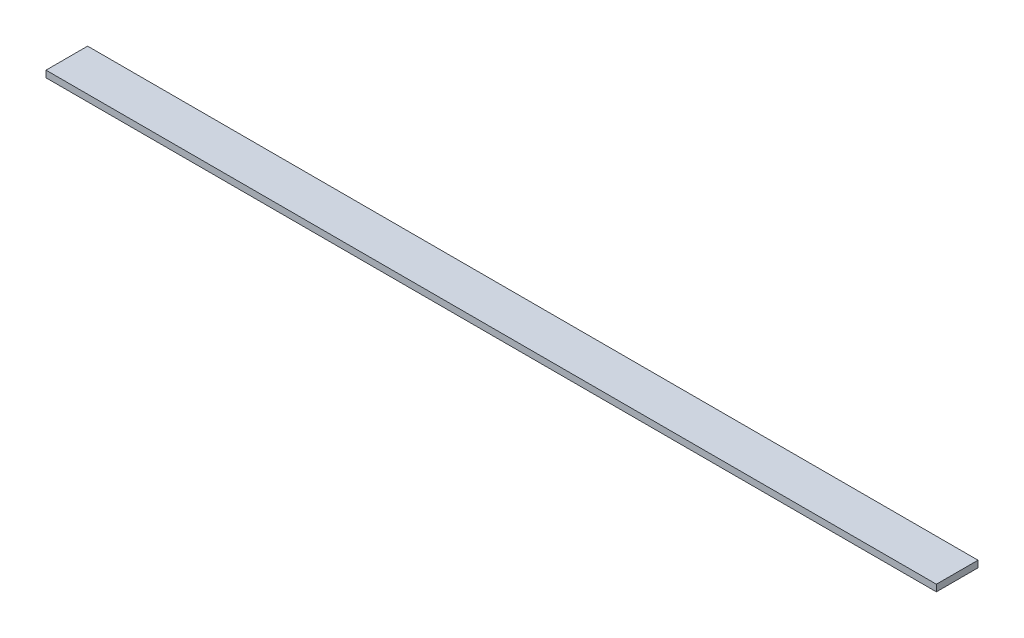
ISO-10303-21;
HEADER;
FILE_DESCRIPTION(('STEP AP214'),'2;1');
FILE_NAME('part.step','',(''),(''),'','','');
FILE_SCHEMA(('AUTOMOTIVE_DESIGN { 1 0 10303 214 1 1 1 1 }'));
ENDSEC;
DATA;
#1=APPLICATION_CONTEXT('core data for automotive mechanical design processes');
#2=APPLICATION_PROTOCOL_DEFINITION('international standard','automotive_design',2000,#1);
#3=PRODUCT_CONTEXT('',#1,'mechanical');
#4=PRODUCT('Part','Part','',(#3));
#5=PRODUCT_RELATED_PRODUCT_CATEGORY('part','',(#4));
#6=PRODUCT_DEFINITION_FORMATION('','',#4);
#7=PRODUCT_DEFINITION_CONTEXT('part definition',#1,'design');
#8=PRODUCT_DEFINITION('design','',#6,#7);
#9=PRODUCT_DEFINITION_SHAPE('','',#8);
#10=(LENGTH_UNIT() NAMED_UNIT(*) SI_UNIT(.MILLI.,.METRE.));
#11=(NAMED_UNIT(*) PLANE_ANGLE_UNIT() SI_UNIT($,.RADIAN.));
#12=(NAMED_UNIT(*) SI_UNIT($,.STERADIAN.) SOLID_ANGLE_UNIT());
#13=UNCERTAINTY_MEASURE_WITH_UNIT(LENGTH_MEASURE(1.E-05),#10,'distance_accuracy_value','');
#14=(GEOMETRIC_REPRESENTATION_CONTEXT(3) GLOBAL_UNCERTAINTY_ASSIGNED_CONTEXT((#13)) GLOBAL_UNIT_ASSIGNED_CONTEXT((#10,
#11,#12)) REPRESENTATION_CONTEXT('',''));
#15=CARTESIAN_POINT('',(0.,0.,0.));
#16=DIRECTION('',(0.,0.,1.));
#17=DIRECTION('',(1.,0.,0.));
#18=AXIS2_PLACEMENT_3D('',#15,#16,#17);
#19=CARTESIAN_POINT('',(1070.,0.,25.));
#20=DIRECTION('',(0.,0.,-1.));
#21=DIRECTION('',(-1.,0.,0.));
#22=AXIS2_PLACEMENT_3D('',#19,#20,#21);
#23=PLANE('',#22);
#24=DIRECTION('',(0.,-1.,0.));
#25=VECTOR('',#24,1.);
#26=CARTESIAN_POINT('',(0.,0.,25.));
#27=LINE('',#26,#25);
#28=CARTESIAN_POINT('',(0.,8.,25.));
#29=VERTEX_POINT('',#28);
#30=CARTESIAN_POINT('',(0.,0.,25.));
#31=VERTEX_POINT('',#30);
#32=EDGE_CURVE('E100',#29,#31,#27,.T.);
#33=ORIENTED_EDGE('',*,*,#32,.T.);
#34=DIRECTION('',(-1.,0.,0.));
#35=VECTOR('',#34,1.);
#36=CARTESIAN_POINT('',(1070.,0.,25.));
#37=LINE('',#36,#35);
#38=CARTESIAN_POINT('',(1070.,0.,25.));
#39=VERTEX_POINT('',#38);
#40=EDGE_CURVE('E11',#39,#31,#37,.T.);
#41=ORIENTED_EDGE('',*,*,#40,.F.);
#42=DIRECTION('',(0.,-1.,0.));
#43=VECTOR('',#42,1.);
#44=CARTESIAN_POINT('',(1070.,0.,25.));
#45=LINE('',#44,#43);
#46=CARTESIAN_POINT('',(1070.,8.,25.));
#47=VERTEX_POINT('',#46);
#48=EDGE_CURVE('E88',#47,#39,#45,.T.);
#49=ORIENTED_EDGE('',*,*,#48,.F.);
#50=DIRECTION('',(-1.,0.,0.));
#51=VECTOR('',#50,1.);
#52=CARTESIAN_POINT('',(1070.,8.,25.));
#53=LINE('',#52,#51);
#54=EDGE_CURVE('E96',#47,#29,#53,.T.);
#55=ORIENTED_EDGE('',*,*,#54,.T.);
#56=EDGE_LOOP('',(#33,#41,#49,#55));
#57=FACE_BOUND('',#56,.T.);
#58=ADVANCED_FACE('F37',(#57),#23,.F.);
#59=CARTESIAN_POINT('',(1070.,0.,25.));
#60=DIRECTION('',(0.,1.,0.));
#61=DIRECTION('',(0.,0.,1.));
#62=AXIS2_PLACEMENT_3D('',#59,#60,#61);
#63=PLANE('',#62);
#64=DIRECTION('',(0.,0.,-1.));
#65=VECTOR('',#64,1.);
#66=CARTESIAN_POINT('',(0.,0.,25.));
#67=LINE('',#66,#65);
#68=CARTESIAN_POINT('',(0.,0.,-25.));
#69=VERTEX_POINT('',#68);
#70=EDGE_CURVE('E92',#31,#69,#67,.T.);
#71=ORIENTED_EDGE('',*,*,#70,.T.);
#72=DIRECTION('',(-1.,0.,0.));
#73=VECTOR('',#72,1.);
#74=CARTESIAN_POINT('',(1070.,0.,-25.));
#75=LINE('',#74,#73);
#76=CARTESIAN_POINT('',(1070.,0.,-25.));
#77=VERTEX_POINT('',#76);
#78=EDGE_CURVE('E45',#77,#69,#75,.T.);
#79=ORIENTED_EDGE('',*,*,#78,.F.);
#80=DIRECTION('',(0.,0.,-1.));
#81=VECTOR('',#80,1.);
#82=CARTESIAN_POINT('',(1070.,0.,25.));
#83=LINE('',#82,#81);
#84=EDGE_CURVE('E83',#39,#77,#83,.T.);
#85=ORIENTED_EDGE('',*,*,#84,.F.);
#86=ORIENTED_EDGE('',*,*,#40,.T.);
#87=EDGE_LOOP('',(#71,#79,#85,#86));
#88=FACE_BOUND('',#87,.T.);
#89=ADVANCED_FACE('F91',(#88),#63,.F.);
#90=CARTESIAN_POINT('',(1070.,0.,-25.));
#91=DIRECTION('',(0.,0.,1.));
#92=DIRECTION('',(1.,0.,0.));
#93=AXIS2_PLACEMENT_3D('',#90,#91,#92);
#94=PLANE('',#93);
#95=DIRECTION('',(0.,1.,0.));
#96=VECTOR('',#95,1.);
#97=CARTESIAN_POINT('',(0.,0.,-25.));
#98=LINE('',#97,#96);
#99=CARTESIAN_POINT('',(0.,8.00000000000001,-25.));
#100=VERTEX_POINT('',#99);
#101=EDGE_CURVE('E70',#69,#100,#98,.T.);
#102=ORIENTED_EDGE('',*,*,#101,.T.);
#103=DIRECTION('',(-1.,0.,0.));
#104=VECTOR('',#103,1.);
#105=CARTESIAN_POINT('',(1070.,8.00000000000001,-25.));
#106=LINE('',#105,#104);
#107=CARTESIAN_POINT('',(1070.,8.00000000000001,-25.));
#108=VERTEX_POINT('',#107);
#109=EDGE_CURVE('E93',#108,#100,#106,.T.);
#110=ORIENTED_EDGE('',*,*,#109,.F.);
#111=DIRECTION('',(0.,1.,0.));
#112=VECTOR('',#111,1.);
#113=CARTESIAN_POINT('',(1070.,0.,-25.));
#114=LINE('',#113,#112);
#115=EDGE_CURVE('E86',#77,#108,#114,.T.);
#116=ORIENTED_EDGE('',*,*,#115,.F.);
#117=ORIENTED_EDGE('',*,*,#78,.T.);
#118=EDGE_LOOP('',(#102,#110,#116,#117));
#119=FACE_BOUND('',#118,.T.);
#120=ADVANCED_FACE('F94',(#119),#94,.F.);
#121=CARTESIAN_POINT('',(1070.,8.,25.));
#122=DIRECTION('',(0.,-1.,0.));
#123=DIRECTION('',(0.,0.,-1.));
#124=AXIS2_PLACEMENT_3D('',#121,#122,#123);
#125=PLANE('',#124);
#126=DIRECTION('',(0.,0.,1.));
#127=VECTOR('',#126,1.);
#128=CARTESIAN_POINT('',(0.,8.,25.));
#129=LINE('',#128,#127);
#130=EDGE_CURVE('E76',#100,#29,#129,.T.);
#131=ORIENTED_EDGE('',*,*,#130,.T.);
#132=ORIENTED_EDGE('',*,*,#54,.F.);
#133=DIRECTION('',(0.,0.,1.));
#134=VECTOR('',#133,1.);
#135=CARTESIAN_POINT('',(1070.,8.,25.));
#136=LINE('',#135,#134);
#137=EDGE_CURVE('E53',#108,#47,#136,.T.);
#138=ORIENTED_EDGE('',*,*,#137,.F.);
#139=ORIENTED_EDGE('',*,*,#109,.T.);
#140=EDGE_LOOP('',(#131,#132,#138,#139));
#141=FACE_BOUND('',#140,.T.);
#142=ADVANCED_FACE('F107',(#141),#125,.F.);
#143=CARTESIAN_POINT('',(1070.,0.,0.));
#144=DIRECTION('',(-1.,0.,0.));
#145=DIRECTION('',(0.,0.,1.));
#146=AXIS2_PLACEMENT_3D('',#143,#144,#145);
#147=PLANE('',#146);
#148=ORIENTED_EDGE('',*,*,#48,.T.);
#149=ORIENTED_EDGE('',*,*,#84,.T.);
#150=ORIENTED_EDGE('',*,*,#115,.T.);
#151=ORIENTED_EDGE('',*,*,#137,.T.);
#152=EDGE_LOOP('',(#148,#149,#150,#151));
#153=FACE_BOUND('',#152,.T.);
#154=ADVANCED_FACE('F84',(#153),#147,.F.);
#155=CARTESIAN_POINT('',(0.,0.,0.));
#156=DIRECTION('',(-1.,0.,0.));
#157=DIRECTION('',(0.,0.,1.));
#158=AXIS2_PLACEMENT_3D('',#155,#156,#157);
#159=PLANE('',#158);
#160=ORIENTED_EDGE('',*,*,#32,.F.);
#161=ORIENTED_EDGE('',*,*,#130,.F.);
#162=ORIENTED_EDGE('',*,*,#101,.F.);
#163=ORIENTED_EDGE('',*,*,#70,.F.);
#164=EDGE_LOOP('',(#160,#161,#162,#163));
#165=FACE_BOUND('',#164,.T.);
#166=ADVANCED_FACE('F110',(#165),#159,.T.);
#167=CLOSED_SHELL('',(#58,#89,#120,#142,#154,#166));
#168=MANIFOLD_SOLID_BREP('B2',#167);
#169=ADVANCED_BREP_SHAPE_REPRESENTATION('',(#18,#168),#14);
#170=SHAPE_DEFINITION_REPRESENTATION(#9,#169);
ENDSEC;
END-ISO-10303-21;
